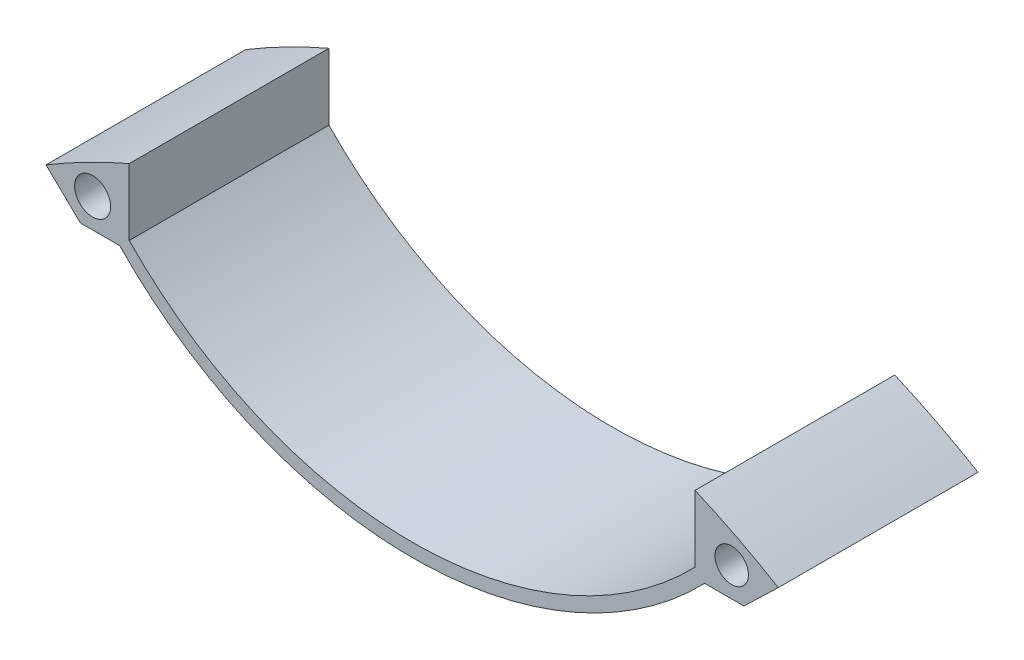
ISO-10303-21;
HEADER;
FILE_DESCRIPTION(('STEP AP214'),'2;1');
FILE_NAME('part.step','',(''),(''),'','','');
FILE_SCHEMA(('AUTOMOTIVE_DESIGN { 1 0 10303 214 1 1 1 1 }'));
ENDSEC;
DATA;
#1=APPLICATION_CONTEXT('core data for automotive mechanical design processes');
#2=APPLICATION_PROTOCOL_DEFINITION('international standard','automotive_design',2000,#1);
#3=PRODUCT_CONTEXT('',#1,'mechanical');
#4=PRODUCT('Part','Part','',(#3));
#5=PRODUCT_RELATED_PRODUCT_CATEGORY('part','',(#4));
#6=PRODUCT_DEFINITION_FORMATION('','',#4);
#7=PRODUCT_DEFINITION_CONTEXT('part definition',#1,'design');
#8=PRODUCT_DEFINITION('design','',#6,#7);
#9=PRODUCT_DEFINITION_SHAPE('','',#8);
#10=(LENGTH_UNIT() NAMED_UNIT(*) SI_UNIT(.MILLI.,.METRE.));
#11=(NAMED_UNIT(*) PLANE_ANGLE_UNIT() SI_UNIT($,.RADIAN.));
#12=(NAMED_UNIT(*) SI_UNIT($,.STERADIAN.) SOLID_ANGLE_UNIT());
#13=UNCERTAINTY_MEASURE_WITH_UNIT(LENGTH_MEASURE(1.E-05),#10,'distance_accuracy_value','');
#14=(GEOMETRIC_REPRESENTATION_CONTEXT(3) GLOBAL_UNCERTAINTY_ASSIGNED_CONTEXT((#13)) GLOBAL_UNIT_ASSIGNED_CONTEXT((#10,
#11,#12)) REPRESENTATION_CONTEXT('',''));
#15=CARTESIAN_POINT('',(0.,0.,0.));
#16=DIRECTION('',(0.,0.,1.));
#17=DIRECTION('',(1.,0.,0.));
#18=AXIS2_PLACEMENT_3D('',#15,#16,#17);
#19=CARTESIAN_POINT('',(0.,-107.,30.));
#20=DIRECTION('',(0.,0.,1.));
#21=DIRECTION('',(1.,0.,0.));
#22=AXIS2_PLACEMENT_3D('',#19,#20,#21);
#23=PLANE('',#22);
#24=CARTESIAN_POINT('',(-48.,-15.8024949400444,30.));
#25=DIRECTION('',(0.,0.,1.));
#26=DIRECTION('',(1.,0.,0.));
#27=AXIS2_PLACEMENT_3D('',#24,#25,#26);
#28=CIRCLE('',#27,2.70296280260852);
#29=CARTESIAN_POINT('',(-45.2970371973915,-15.8024949400444,30.));
#30=VERTEX_POINT('',#29);
#31=EDGE_CURVE('E150',#30,#30,#28,.T.);
#32=ORIENTED_EDGE('',*,*,#31,.F.);
#33=EDGE_LOOP('',(#32));
#34=FACE_BOUND('',#33,.T.);
#35=CARTESIAN_POINT('',(0.,-107.,30.));
#36=DIRECTION('',(0.,0.,1.));
#37=DIRECTION('',(1.,0.,0.));
#38=AXIS2_PLACEMENT_3D('',#35,#36,#37);
#39=CIRCLE('',#38,107.);
#40=CARTESIAN_POINT('',(-42.5,-8.80249494004443,30.));
#41=VERTEX_POINT('',#40);
#42=CARTESIAN_POINT('',(-55.,-15.2176487553299,30.));
#43=VERTEX_POINT('',#42);
#44=EDGE_CURVE('E165',#41,#43,#39,.T.);
#45=ORIENTED_EDGE('',*,*,#44,.T.);
#46=DIRECTION('',(0.720348863645207,-0.693611933753348,0.));
#47=VECTOR('',#46,1.);
#48=CARTESIAN_POINT('',(-49.8317033023536,-20.19411564184,30.));
#49=LINE('',#48,#47);
#50=CARTESIAN_POINT('',(-49.8317033023536,-20.19411564184,30.));
#51=VERTEX_POINT('',#50);
#52=EDGE_CURVE('E103',#43,#51,#49,.T.);
#53=ORIENTED_EDGE('',*,*,#52,.T.);
#54=DIRECTION('',(1.,0.,0.));
#55=VECTOR('',#54,1.);
#56=CARTESIAN_POINT('',(-43.9364511207605,-20.19411564184,30.));
#57=LINE('',#56,#55);
#58=CARTESIAN_POINT('',(-43.9364511207605,-20.19411564184,30.));
#59=VERTEX_POINT('',#58);
#60=EDGE_CURVE('E186',#51,#59,#57,.T.);
#61=ORIENTED_EDGE('',*,*,#60,.T.);
#62=CARTESIAN_POINT('',(0.,22.3711161710667,30.));
#63=DIRECTION('',(0.,0.,1.));
#64=DIRECTION('',(1.,0.,0.));
#65=AXIS2_PLACEMENT_3D('',#62,#63,#64);
#66=CIRCLE('',#65,61.1736111111111);
#67=CARTESIAN_POINT('',(43.9364511207605,-20.19411564184,30.));
#68=VERTEX_POINT('',#67);
#69=EDGE_CURVE('E205',#59,#68,#66,.T.);
#70=ORIENTED_EDGE('',*,*,#69,.T.);
#71=DIRECTION('',(1.,0.,0.));
#72=VECTOR('',#71,1.);
#73=CARTESIAN_POINT('',(43.9364511207605,-20.19411564184,30.));
#74=LINE('',#73,#72);
#75=CARTESIAN_POINT('',(49.8317033023536,-20.19411564184,30.));
#76=VERTEX_POINT('',#75);
#77=EDGE_CURVE('E202',#68,#76,#74,.T.);
#78=ORIENTED_EDGE('',*,*,#77,.T.);
#79=DIRECTION('',(0.720348863645208,0.693611933753347,0.));
#80=VECTOR('',#79,1.);
#81=CARTESIAN_POINT('',(49.8317033023536,-20.19411564184,30.));
#82=LINE('',#81,#80);
#83=CARTESIAN_POINT('',(55.,-15.2176487553299,30.));
#84=VERTEX_POINT('',#83);
#85=EDGE_CURVE('E204',#76,#84,#82,.T.);
#86=ORIENTED_EDGE('',*,*,#85,.T.);
#87=CARTESIAN_POINT('',(0.,-107.,30.));
#88=DIRECTION('',(0.,0.,1.));
#89=DIRECTION('',(-1.,0.,0.));
#90=AXIS2_PLACEMENT_3D('',#87,#88,#89);
#91=CIRCLE('',#90,107.);
#92=CARTESIAN_POINT('',(42.5,-8.80249494004443,30.));
#93=VERTEX_POINT('',#92);
#94=EDGE_CURVE('E128',#84,#93,#91,.T.);
#95=ORIENTED_EDGE('',*,*,#94,.T.);
#96=DIRECTION('',(0.,-1.,0.));
#97=VECTOR('',#96,1.);
#98=CARTESIAN_POINT('',(42.5,-18.8024949400444,30.));
#99=LINE('',#98,#97);
#100=CARTESIAN_POINT('',(42.5,-18.8024949400444,30.));
#101=VERTEX_POINT('',#100);
#102=EDGE_CURVE('E122',#93,#101,#99,.T.);
#103=ORIENTED_EDGE('',*,*,#102,.T.);
#104=CARTESIAN_POINT('',(0.,22.3711161710667,30.));
#105=DIRECTION('',(0.,0.,-1.));
#106=DIRECTION('',(1.,0.,0.));
#107=AXIS2_PLACEMENT_3D('',#104,#105,#106);
#108=CIRCLE('',#107,59.1736111111111);
#109=CARTESIAN_POINT('',(-42.5,-18.8024949400444,30.));
#110=VERTEX_POINT('',#109);
#111=EDGE_CURVE('E126',#101,#110,#108,.T.);
#112=ORIENTED_EDGE('',*,*,#111,.T.);
#113=DIRECTION('',(0.,1.,0.));
#114=VECTOR('',#113,1.);
#115=CARTESIAN_POINT('',(-42.5,-8.80249494004443,30.));
#116=LINE('',#115,#114);
#117=EDGE_CURVE('E54',#110,#41,#116,.T.);
#118=ORIENTED_EDGE('',*,*,#117,.T.);
#119=EDGE_LOOP('',(#45,#53,#61,#70,#78,#86,#95,#103,#112,#118));
#120=FACE_BOUND('',#119,.T.);
#121=CARTESIAN_POINT('',(48.,-15.8024949400444,30.));
#122=DIRECTION('',(0.,0.,1.));
#123=DIRECTION('',(1.,0.,0.));
#124=AXIS2_PLACEMENT_3D('',#121,#122,#123);
#125=CIRCLE('',#124,2.51059820201879);
#126=CARTESIAN_POINT('',(50.5105982020188,-15.8024949400444,30.));
#127=VERTEX_POINT('',#126);
#128=EDGE_CURVE('E216',#127,#127,#125,.T.);
#129=ORIENTED_EDGE('',*,*,#128,.F.);
#130=EDGE_LOOP('',(#129));
#131=FACE_BOUND('',#130,.T.);
#132=ADVANCED_FACE('F37',(#34,#120,#131),#23,.T.);
#133=CARTESIAN_POINT('',(0.,-107.,0.));
#134=DIRECTION('',(0.,0.,1.));
#135=DIRECTION('',(1.,0.,0.));
#136=AXIS2_PLACEMENT_3D('',#133,#134,#135);
#137=PLANE('',#136);
#138=CARTESIAN_POINT('',(0.,-107.,0.));
#139=DIRECTION('',(0.,0.,1.));
#140=DIRECTION('',(1.,0.,0.));
#141=AXIS2_PLACEMENT_3D('',#138,#139,#140);
#142=CIRCLE('',#141,107.);
#143=CARTESIAN_POINT('',(-42.5,-8.80249494004443,0.));
#144=VERTEX_POINT('',#143);
#145=CARTESIAN_POINT('',(-55.,-15.2176487553299,0.));
#146=VERTEX_POINT('',#145);
#147=EDGE_CURVE('E146',#144,#146,#142,.T.);
#148=ORIENTED_EDGE('',*,*,#147,.F.);
#149=DIRECTION('',(0.,1.,0.));
#150=VECTOR('',#149,1.);
#151=CARTESIAN_POINT('',(-42.5,-8.80249494004443,0.));
#152=LINE('',#151,#150);
#153=CARTESIAN_POINT('',(-42.5,-18.8024949400444,0.));
#154=VERTEX_POINT('',#153);
#155=EDGE_CURVE('E95',#154,#144,#152,.T.);
#156=ORIENTED_EDGE('',*,*,#155,.F.);
#157=CARTESIAN_POINT('',(0.,22.3711161710667,0.));
#158=DIRECTION('',(0.,0.,-1.));
#159=DIRECTION('',(1.,0.,0.));
#160=AXIS2_PLACEMENT_3D('',#157,#158,#159);
#161=CIRCLE('',#160,59.1736111111111);
#162=CARTESIAN_POINT('',(42.5,-18.8024949400444,0.));
#163=VERTEX_POINT('',#162);
#164=EDGE_CURVE('E89',#163,#154,#161,.T.);
#165=ORIENTED_EDGE('',*,*,#164,.F.);
#166=DIRECTION('',(0.,-1.,0.));
#167=VECTOR('',#166,1.);
#168=CARTESIAN_POINT('',(42.5,-18.8024949400444,0.));
#169=LINE('',#168,#167);
#170=CARTESIAN_POINT('',(42.5,-8.80249494004443,0.));
#171=VERTEX_POINT('',#170);
#172=EDGE_CURVE('E136',#171,#163,#169,.T.);
#173=ORIENTED_EDGE('',*,*,#172,.F.);
#174=CARTESIAN_POINT('',(0.,-107.,0.));
#175=DIRECTION('',(0.,0.,1.));
#176=DIRECTION('',(-1.,0.,0.));
#177=AXIS2_PLACEMENT_3D('',#174,#175,#176);
#178=CIRCLE('',#177,107.);
#179=CARTESIAN_POINT('',(55.,-15.2176487553299,0.));
#180=VERTEX_POINT('',#179);
#181=EDGE_CURVE('E160',#180,#171,#178,.T.);
#182=ORIENTED_EDGE('',*,*,#181,.F.);
#183=DIRECTION('',(0.720348863645208,0.693611933753347,0.));
#184=VECTOR('',#183,1.);
#185=CARTESIAN_POINT('',(49.8317033023536,-20.19411564184,0.));
#186=LINE('',#185,#184);
#187=CARTESIAN_POINT('',(49.8317033023536,-20.19411564184,0.));
#188=VERTEX_POINT('',#187);
#189=EDGE_CURVE('E158',#188,#180,#186,.T.);
#190=ORIENTED_EDGE('',*,*,#189,.F.);
#191=DIRECTION('',(1.,0.,0.));
#192=VECTOR('',#191,1.);
#193=CARTESIAN_POINT('',(43.9364511207605,-20.19411564184,0.));
#194=LINE('',#193,#192);
#195=CARTESIAN_POINT('',(43.9364511207605,-20.19411564184,0.));
#196=VERTEX_POINT('',#195);
#197=EDGE_CURVE('E156',#196,#188,#194,.T.);
#198=ORIENTED_EDGE('',*,*,#197,.F.);
#199=CARTESIAN_POINT('',(0.,22.3711161710667,0.));
#200=DIRECTION('',(0.,0.,1.));
#201=DIRECTION('',(1.,0.,0.));
#202=AXIS2_PLACEMENT_3D('',#199,#200,#201);
#203=CIRCLE('',#202,61.1736111111111);
#204=CARTESIAN_POINT('',(-43.9364511207605,-20.19411564184,0.));
#205=VERTEX_POINT('',#204);
#206=EDGE_CURVE('E154',#205,#196,#203,.T.);
#207=ORIENTED_EDGE('',*,*,#206,.F.);
#208=DIRECTION('',(1.,0.,0.));
#209=VECTOR('',#208,1.);
#210=CARTESIAN_POINT('',(-43.9364511207605,-20.19411564184,0.));
#211=LINE('',#210,#209);
#212=CARTESIAN_POINT('',(-49.8317033023536,-20.19411564184,0.));
#213=VERTEX_POINT('',#212);
#214=EDGE_CURVE('E152',#213,#205,#211,.T.);
#215=ORIENTED_EDGE('',*,*,#214,.F.);
#216=DIRECTION('',(0.720348863645207,-0.693611933753348,0.));
#217=VECTOR('',#216,1.);
#218=CARTESIAN_POINT('',(-49.8317033023536,-20.19411564184,0.));
#219=LINE('',#218,#217);
#220=EDGE_CURVE('E149',#146,#213,#219,.T.);
#221=ORIENTED_EDGE('',*,*,#220,.F.);
#222=EDGE_LOOP('',(#148,#156,#165,#173,#182,#190,#198,#207,#215,#221));
#223=FACE_BOUND('',#222,.T.);
#224=CARTESIAN_POINT('',(-48.,-15.8024949400444,0.));
#225=DIRECTION('',(0.,0.,1.));
#226=DIRECTION('',(1.,0.,0.));
#227=AXIS2_PLACEMENT_3D('',#224,#225,#226);
#228=CIRCLE('',#227,2.70296280260852);
#229=CARTESIAN_POINT('',(-45.2970371973915,-15.8024949400444,0.));
#230=VERTEX_POINT('',#229);
#231=EDGE_CURVE('E213',#230,#230,#228,.T.);
#232=ORIENTED_EDGE('',*,*,#231,.T.);
#233=EDGE_LOOP('',(#232));
#234=FACE_BOUND('',#233,.T.);
#235=CARTESIAN_POINT('',(48.,-15.8024949400444,0.));
#236=DIRECTION('',(0.,0.,1.));
#237=DIRECTION('',(1.,0.,0.));
#238=AXIS2_PLACEMENT_3D('',#235,#236,#237);
#239=CIRCLE('',#238,2.51059820201879);
#240=CARTESIAN_POINT('',(50.5105982020188,-15.8024949400444,0.));
#241=VERTEX_POINT('',#240);
#242=EDGE_CURVE('E219',#241,#241,#239,.T.);
#243=ORIENTED_EDGE('',*,*,#242,.T.);
#244=EDGE_LOOP('',(#243));
#245=FACE_BOUND('',#244,.T.);
#246=ADVANCED_FACE('F190',(#223,#234,#245),#137,.F.);
#247=CARTESIAN_POINT('',(0.,-107.,30.));
#248=DIRECTION('',(0.,0.,-1.));
#249=DIRECTION('',(-1.,0.,0.));
#250=AXIS2_PLACEMENT_3D('',#247,#248,#249);
#251=CYLINDRICAL_SURFACE('',#250,107.);
#252=ORIENTED_EDGE('',*,*,#147,.T.);
#253=DIRECTION('',(0.,0.,-1.));
#254=VECTOR('',#253,1.);
#255=CARTESIAN_POINT('',(-55.,-15.2176487553299,30.));
#256=LINE('',#255,#254);
#257=EDGE_CURVE('E11',#43,#146,#256,.T.);
#258=ORIENTED_EDGE('',*,*,#257,.F.);
#259=ORIENTED_EDGE('',*,*,#44,.F.);
#260=DIRECTION('',(0.,0.,-1.));
#261=VECTOR('',#260,1.);
#262=CARTESIAN_POINT('',(-42.5,-8.80249494004443,30.));
#263=LINE('',#262,#261);
#264=EDGE_CURVE('E142',#41,#144,#263,.T.);
#265=ORIENTED_EDGE('',*,*,#264,.T.);
#266=EDGE_LOOP('',(#252,#258,#259,#265));
#267=FACE_BOUND('',#266,.T.);
#268=ADVANCED_FACE('F39',(#267),#251,.T.);
#269=CARTESIAN_POINT('',(-49.8317033023536,-20.19411564184,30.));
#270=DIRECTION('',(0.693611933753348,0.720348863645207,0.));
#271=DIRECTION('',(-0.720348863645207,0.693611933753348,0.));
#272=AXIS2_PLACEMENT_3D('',#269,#270,#271);
#273=PLANE('',#272);
#274=ORIENTED_EDGE('',*,*,#220,.T.);
#275=DIRECTION('',(0.,0.,-1.));
#276=VECTOR('',#275,1.);
#277=CARTESIAN_POINT('',(-49.8317033023536,-20.19411564184,30.));
#278=LINE('',#277,#276);
#279=EDGE_CURVE('E46',#51,#213,#278,.T.);
#280=ORIENTED_EDGE('',*,*,#279,.F.);
#281=ORIENTED_EDGE('',*,*,#52,.F.);
#282=ORIENTED_EDGE('',*,*,#257,.T.);
#283=EDGE_LOOP('',(#274,#280,#281,#282));
#284=FACE_BOUND('',#283,.T.);
#285=ADVANCED_FACE('F259',(#284),#273,.F.);
#286=CARTESIAN_POINT('',(-43.9364511207605,-20.19411564184,30.));
#287=DIRECTION('',(0.,1.,0.));
#288=DIRECTION('',(0.,0.,1.));
#289=AXIS2_PLACEMENT_3D('',#286,#287,#288);
#290=PLANE('',#289);
#291=ORIENTED_EDGE('',*,*,#214,.T.);
#292=DIRECTION('',(0.,0.,-1.));
#293=VECTOR('',#292,1.);
#294=CARTESIAN_POINT('',(-43.9364511207605,-20.19411564184,30.));
#295=LINE('',#294,#293);
#296=EDGE_CURVE('E178',#59,#205,#295,.T.);
#297=ORIENTED_EDGE('',*,*,#296,.F.);
#298=ORIENTED_EDGE('',*,*,#60,.F.);
#299=ORIENTED_EDGE('',*,*,#279,.T.);
#300=EDGE_LOOP('',(#291,#297,#298,#299));
#301=FACE_BOUND('',#300,.T.);
#302=ADVANCED_FACE('F184',(#301),#290,.F.);
#303=CARTESIAN_POINT('',(0.,22.3711161710667,30.));
#304=DIRECTION('',(0.,0.,-1.));
#305=DIRECTION('',(-1.,0.,0.));
#306=AXIS2_PLACEMENT_3D('',#303,#304,#305);
#307=CYLINDRICAL_SURFACE('',#306,61.1736111111111);
#308=ORIENTED_EDGE('',*,*,#206,.T.);
#309=DIRECTION('',(0.,0.,-1.));
#310=VECTOR('',#309,1.);
#311=CARTESIAN_POINT('',(43.9364511207605,-20.19411564184,30.));
#312=LINE('',#311,#310);
#313=EDGE_CURVE('E175',#68,#196,#312,.T.);
#314=ORIENTED_EDGE('',*,*,#313,.F.);
#315=ORIENTED_EDGE('',*,*,#69,.F.);
#316=ORIENTED_EDGE('',*,*,#296,.T.);
#317=EDGE_LOOP('',(#308,#314,#315,#316));
#318=FACE_BOUND('',#317,.T.);
#319=ADVANCED_FACE('F196',(#318),#307,.T.);
#320=CARTESIAN_POINT('',(43.9364511207605,-20.19411564184,30.));
#321=DIRECTION('',(0.,1.,0.));
#322=DIRECTION('',(-1.,0.,0.));
#323=AXIS2_PLACEMENT_3D('',#320,#321,#322);
#324=PLANE('',#323);
#325=ORIENTED_EDGE('',*,*,#197,.T.);
#326=DIRECTION('',(0.,0.,-1.));
#327=VECTOR('',#326,1.);
#328=CARTESIAN_POINT('',(49.8317033023536,-20.19411564184,30.));
#329=LINE('',#328,#327);
#330=EDGE_CURVE('E172',#76,#188,#329,.T.);
#331=ORIENTED_EDGE('',*,*,#330,.F.);
#332=ORIENTED_EDGE('',*,*,#77,.F.);
#333=ORIENTED_EDGE('',*,*,#313,.T.);
#334=EDGE_LOOP('',(#325,#331,#332,#333));
#335=FACE_BOUND('',#334,.T.);
#336=ADVANCED_FACE('F200',(#335),#324,.F.);
#337=CARTESIAN_POINT('',(49.8317033023536,-20.19411564184,30.));
#338=DIRECTION('',(-0.693611933753347,0.720348863645208,0.));
#339=DIRECTION('',(-0.720348863645208,-0.693611933753347,0.));
#340=AXIS2_PLACEMENT_3D('',#337,#338,#339);
#341=PLANE('',#340);
#342=ORIENTED_EDGE('',*,*,#189,.T.);
#343=DIRECTION('',(0.,0.,-1.));
#344=VECTOR('',#343,1.);
#345=CARTESIAN_POINT('',(55.,-15.2176487553299,30.));
#346=LINE('',#345,#344);
#347=EDGE_CURVE('E169',#84,#180,#346,.T.);
#348=ORIENTED_EDGE('',*,*,#347,.F.);
#349=ORIENTED_EDGE('',*,*,#85,.F.);
#350=ORIENTED_EDGE('',*,*,#330,.T.);
#351=EDGE_LOOP('',(#342,#348,#349,#350));
#352=FACE_BOUND('',#351,.T.);
#353=ADVANCED_FACE('F249',(#352),#341,.F.);
#354=CARTESIAN_POINT('',(0.,-107.,30.));
#355=DIRECTION('',(0.,0.,-1.));
#356=DIRECTION('',(-1.,0.,0.));
#357=AXIS2_PLACEMENT_3D('',#354,#355,#356);
#358=CYLINDRICAL_SURFACE('',#357,107.);
#359=ORIENTED_EDGE('',*,*,#181,.T.);
#360=DIRECTION('',(0.,0.,-1.));
#361=VECTOR('',#360,1.);
#362=CARTESIAN_POINT('',(42.5,-8.80249494004443,30.));
#363=LINE('',#362,#361);
#364=EDGE_CURVE('E137',#93,#171,#363,.T.);
#365=ORIENTED_EDGE('',*,*,#364,.F.);
#366=ORIENTED_EDGE('',*,*,#94,.F.);
#367=ORIENTED_EDGE('',*,*,#347,.T.);
#368=EDGE_LOOP('',(#359,#365,#366,#367));
#369=FACE_BOUND('',#368,.T.);
#370=ADVANCED_FACE('F246',(#369),#358,.T.);
#371=CARTESIAN_POINT('',(42.5,-18.8024949400444,30.));
#372=DIRECTION('',(1.,0.,0.));
#373=DIRECTION('',(0.,0.,-1.));
#374=AXIS2_PLACEMENT_3D('',#371,#372,#373);
#375=PLANE('',#374);
#376=ORIENTED_EDGE('',*,*,#172,.T.);
#377=DIRECTION('',(0.,0.,-1.));
#378=VECTOR('',#377,1.);
#379=CARTESIAN_POINT('',(42.5,-18.8024949400444,30.));
#380=LINE('',#379,#378);
#381=EDGE_CURVE('E133',#101,#163,#380,.T.);
#382=ORIENTED_EDGE('',*,*,#381,.F.);
#383=ORIENTED_EDGE('',*,*,#102,.F.);
#384=ORIENTED_EDGE('',*,*,#364,.T.);
#385=EDGE_LOOP('',(#376,#382,#383,#384));
#386=FACE_BOUND('',#385,.T.);
#387=ADVANCED_FACE('F134',(#386),#375,.F.);
#388=CARTESIAN_POINT('',(0.,22.3711161710667,30.));
#389=DIRECTION('',(0.,0.,-1.));
#390=DIRECTION('',(-1.,0.,0.));
#391=AXIS2_PLACEMENT_3D('',#388,#389,#390);
#392=CYLINDRICAL_SURFACE('',#391,59.1736111111111);
#393=ORIENTED_EDGE('',*,*,#164,.T.);
#394=DIRECTION('',(0.,0.,-1.));
#395=VECTOR('',#394,1.);
#396=CARTESIAN_POINT('',(-42.5,-18.8024949400444,30.));
#397=LINE('',#396,#395);
#398=EDGE_CURVE('E138',#110,#154,#397,.T.);
#399=ORIENTED_EDGE('',*,*,#398,.F.);
#400=ORIENTED_EDGE('',*,*,#111,.F.);
#401=ORIENTED_EDGE('',*,*,#381,.T.);
#402=EDGE_LOOP('',(#393,#399,#400,#401));
#403=FACE_BOUND('',#402,.T.);
#404=ADVANCED_FACE('F140',(#403),#392,.F.);
#405=CARTESIAN_POINT('',(-42.5,-8.80249494004443,30.));
#406=DIRECTION('',(-1.,0.,0.));
#407=DIRECTION('',(0.,0.,1.));
#408=AXIS2_PLACEMENT_3D('',#405,#406,#407);
#409=PLANE('',#408);
#410=ORIENTED_EDGE('',*,*,#155,.T.);
#411=ORIENTED_EDGE('',*,*,#264,.F.);
#412=ORIENTED_EDGE('',*,*,#117,.F.);
#413=ORIENTED_EDGE('',*,*,#398,.T.);
#414=EDGE_LOOP('',(#410,#411,#412,#413));
#415=FACE_BOUND('',#414,.T.);
#416=ADVANCED_FACE('F239',(#415),#409,.F.);
#417=CARTESIAN_POINT('',(-48.,-15.8024949400444,30.));
#418=DIRECTION('',(0.,0.,-1.));
#419=DIRECTION('',(-1.,0.,0.));
#420=AXIS2_PLACEMENT_3D('',#417,#418,#419);
#421=CYLINDRICAL_SURFACE('',#420,2.70296280260852);
#422=ORIENTED_EDGE('',*,*,#31,.T.);
#423=EDGE_LOOP('',(#422));
#424=FACE_BOUND('',#423,.T.);
#425=ORIENTED_EDGE('',*,*,#231,.F.);
#426=EDGE_LOOP('',(#425));
#427=FACE_BOUND('',#426,.T.);
#428=ADVANCED_FACE('F236',(#424,#427),#421,.F.);
#429=CARTESIAN_POINT('',(48.,-15.8024949400444,30.));
#430=DIRECTION('',(0.,0.,-1.));
#431=DIRECTION('',(-1.,0.,0.));
#432=AXIS2_PLACEMENT_3D('',#429,#430,#431);
#433=CYLINDRICAL_SURFACE('',#432,2.51059820201879);
#434=ORIENTED_EDGE('',*,*,#128,.T.);
#435=EDGE_LOOP('',(#434));
#436=FACE_BOUND('',#435,.T.);
#437=ORIENTED_EDGE('',*,*,#242,.F.);
#438=EDGE_LOOP('',(#437));
#439=FACE_BOUND('',#438,.T.);
#440=ADVANCED_FACE('F225',(#436,#439),#433,.F.);
#441=CLOSED_SHELL('',(#132,#246,#268,#285,#302,#319,#336,#353,#370,#387,#404,#416,#428,#440));
#442=MANIFOLD_SOLID_BREP('B2',#441);
#443=ADVANCED_BREP_SHAPE_REPRESENTATION('',(#18,#442),#14);
#444=SHAPE_DEFINITION_REPRESENTATION(#9,#443);
ENDSEC;
END-ISO-10303-21;
